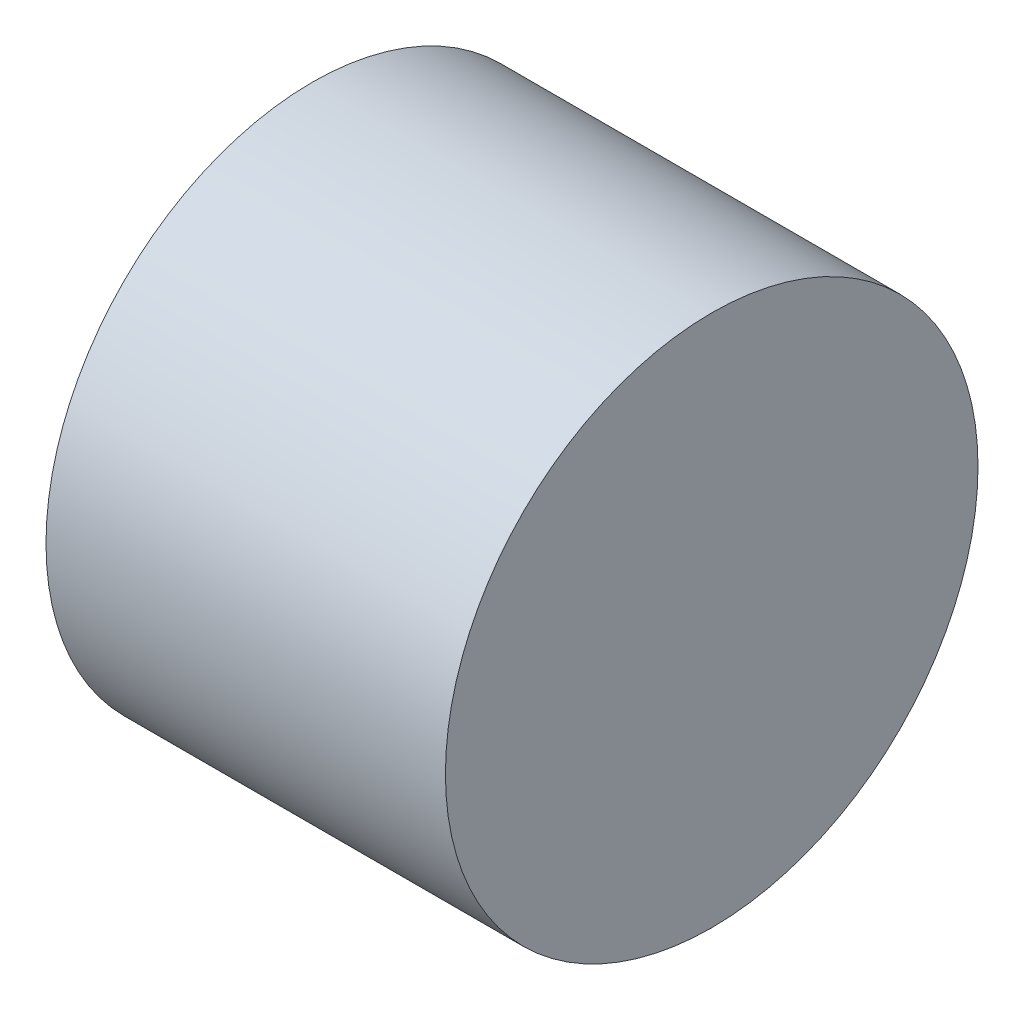
ISO-10303-21;
HEADER;
FILE_DESCRIPTION(('STEP AP214'),'2;1');
FILE_NAME('part.step','',(''),(''),'','','');
FILE_SCHEMA(('AUTOMOTIVE_DESIGN { 1 0 10303 214 1 1 1 1 }'));
ENDSEC;
DATA;
#1=APPLICATION_CONTEXT('core data for automotive mechanical design processes');
#2=APPLICATION_PROTOCOL_DEFINITION('international standard','automotive_design',2000,#1);
#3=PRODUCT_CONTEXT('',#1,'mechanical');
#4=PRODUCT('Part','Part','',(#3));
#5=PRODUCT_RELATED_PRODUCT_CATEGORY('part','',(#4));
#6=PRODUCT_DEFINITION_FORMATION('','',#4);
#7=PRODUCT_DEFINITION_CONTEXT('part definition',#1,'design');
#8=PRODUCT_DEFINITION('design','',#6,#7);
#9=PRODUCT_DEFINITION_SHAPE('','',#8);
#10=(LENGTH_UNIT() NAMED_UNIT(*) SI_UNIT(.MILLI.,.METRE.));
#11=(NAMED_UNIT(*) PLANE_ANGLE_UNIT() SI_UNIT($,.RADIAN.));
#12=(NAMED_UNIT(*) SI_UNIT($,.STERADIAN.) SOLID_ANGLE_UNIT());
#13=UNCERTAINTY_MEASURE_WITH_UNIT(LENGTH_MEASURE(1.E-05),#10,'distance_accuracy_value','');
#14=(GEOMETRIC_REPRESENTATION_CONTEXT(3) GLOBAL_UNCERTAINTY_ASSIGNED_CONTEXT((#13)) GLOBAL_UNIT_ASSIGNED_CONTEXT((#10,
#11,#12)) REPRESENTATION_CONTEXT('',''));
#15=CARTESIAN_POINT('',(0.,0.,0.));
#16=DIRECTION('',(0.,0.,1.));
#17=DIRECTION('',(1.,0.,0.));
#18=AXIS2_PLACEMENT_3D('',#15,#16,#17);
#19=CARTESIAN_POINT('',(0.381,0.,0.));
#20=DIRECTION('',(1.,0.,0.));
#21=DIRECTION('',(0.,0.,-1.));
#22=AXIS2_PLACEMENT_3D('',#19,#20,#21);
#23=PLANE('',#22);
#24=CARTESIAN_POINT('',(0.381,0.,0.));
#25=DIRECTION('',(-1.,0.,0.));
#26=DIRECTION('',(0.,0.,1.));
#27=AXIS2_PLACEMENT_3D('',#24,#25,#26);
#28=CIRCLE('',#27,0.254);
#29=CARTESIAN_POINT('',(0.381,0.,0.254));
#30=VERTEX_POINT('',#29);
#31=EDGE_CURVE('E17',#30,#30,#28,.T.);
#32=ORIENTED_EDGE('',*,*,#31,.F.);
#33=EDGE_LOOP('',(#32));
#34=FACE_BOUND('',#33,.T.);
#35=ADVANCED_FACE('F14',(#34),#23,.T.);
#36=CARTESIAN_POINT('',(0.,0.,0.));
#37=DIRECTION('',(1.,0.,0.));
#38=DIRECTION('',(0.,0.,-1.));
#39=AXIS2_PLACEMENT_3D('',#36,#37,#38);
#40=PLANE('',#39);
#41=CARTESIAN_POINT('',(0.,0.,0.));
#42=DIRECTION('',(-1.,0.,0.));
#43=DIRECTION('',(0.,0.,1.));
#44=AXIS2_PLACEMENT_3D('',#41,#42,#43);
#45=CIRCLE('',#44,0.254);
#46=CARTESIAN_POINT('',(0.,0.,0.254));
#47=VERTEX_POINT('',#46);
#48=EDGE_CURVE('E10',#47,#47,#45,.F.);
#49=ORIENTED_EDGE('',*,*,#48,.F.);
#50=EDGE_LOOP('',(#49));
#51=FACE_BOUND('',#50,.T.);
#52=ADVANCED_FACE('F29',(#51),#40,.F.);
#53=CARTESIAN_POINT('',(0.381,0.,0.));
#54=DIRECTION('',(-1.,0.,0.));
#55=DIRECTION('',(0.,0.,1.));
#56=AXIS2_PLACEMENT_3D('',#53,#54,#55);
#57=CYLINDRICAL_SURFACE('',#56,0.254);
#58=ORIENTED_EDGE('',*,*,#48,.T.);
#59=EDGE_LOOP('',(#58));
#60=FACE_BOUND('',#59,.T.);
#61=ORIENTED_EDGE('',*,*,#31,.T.);
#62=EDGE_LOOP('',(#61));
#63=FACE_BOUND('',#62,.T.);
#64=ADVANCED_FACE('F26',(#60,#63),#57,.T.);
#65=CLOSED_SHELL('',(#35,#52,#64));
#66=MANIFOLD_SOLID_BREP('B1',#65);
#67=ADVANCED_BREP_SHAPE_REPRESENTATION('',(#18,#66),#14);
#68=SHAPE_DEFINITION_REPRESENTATION(#9,#67);
ENDSEC;
END-ISO-10303-21;
